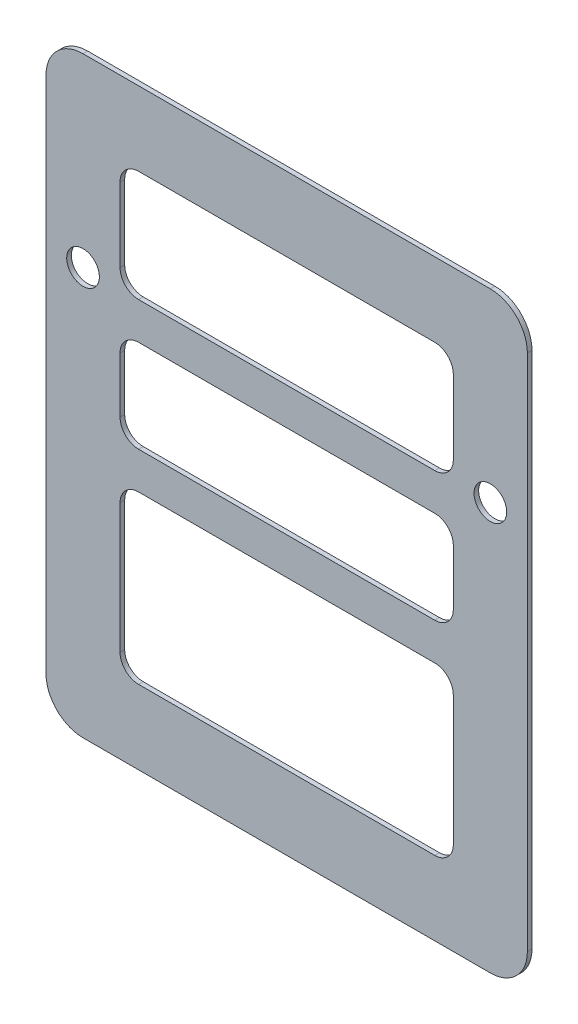
ISO-10303-21;
HEADER;
FILE_DESCRIPTION(('STEP AP214'),'2;1');
FILE_NAME('part.step','',(''),(''),'','','');
FILE_SCHEMA(('AUTOMOTIVE_DESIGN { 1 0 10303 214 1 1 1 1 }'));
ENDSEC;
DATA;
#1=APPLICATION_CONTEXT('core data for automotive mechanical design processes');
#2=APPLICATION_PROTOCOL_DEFINITION('international standard','automotive_design',2000,#1);
#3=PRODUCT_CONTEXT('',#1,'mechanical');
#4=PRODUCT('Part','Part','',(#3));
#5=PRODUCT_RELATED_PRODUCT_CATEGORY('part','',(#4));
#6=PRODUCT_DEFINITION_FORMATION('','',#4);
#7=PRODUCT_DEFINITION_CONTEXT('part definition',#1,'design');
#8=PRODUCT_DEFINITION('design','',#6,#7);
#9=PRODUCT_DEFINITION_SHAPE('','',#8);
#10=(LENGTH_UNIT() NAMED_UNIT(*) SI_UNIT(.MILLI.,.METRE.));
#11=(NAMED_UNIT(*) PLANE_ANGLE_UNIT() SI_UNIT($,.RADIAN.));
#12=(NAMED_UNIT(*) SI_UNIT($,.STERADIAN.) SOLID_ANGLE_UNIT());
#13=UNCERTAINTY_MEASURE_WITH_UNIT(LENGTH_MEASURE(1.E-05),#10,'distance_accuracy_value','');
#14=(GEOMETRIC_REPRESENTATION_CONTEXT(3) GLOBAL_UNCERTAINTY_ASSIGNED_CONTEXT((#13)) GLOBAL_UNIT_ASSIGNED_CONTEXT((#10,
#11,#12)) REPRESENTATION_CONTEXT('',''));
#15=CARTESIAN_POINT('',(0.,0.,0.));
#16=DIRECTION('',(0.,0.,1.));
#17=DIRECTION('',(1.,0.,0.));
#18=AXIS2_PLACEMENT_3D('',#15,#16,#17);
#19=CARTESIAN_POINT('',(-139.7,-177.8,3.175));
#20=DIRECTION('',(0.,0.,-1.));
#21=DIRECTION('',(-1.,0.,0.));
#22=AXIS2_PLACEMENT_3D('',#19,#20,#21);
#23=PLANE('',#22);
#24=CARTESIAN_POINT('',(101.6,0.,3.175));
#25=DIRECTION('',(0.,0.,1.));
#26=DIRECTION('',(1.,0.,0.));
#27=AXIS2_PLACEMENT_3D('',#24,#25,#26);
#28=CIRCLE('',#27,12.7);
#29=CARTESIAN_POINT('',(101.6,-12.7,3.175));
#30=VERTEX_POINT('',#29);
#31=CARTESIAN_POINT('',(114.3,0.,3.175));
#32=VERTEX_POINT('',#31);
#33=EDGE_CURVE('E315',#30,#32,#28,.T.);
#34=ORIENTED_EDGE('',*,*,#33,.F.);
#35=DIRECTION('',(1.,0.,0.));
#36=VECTOR('',#35,1.);
#37=CARTESIAN_POINT('',(-101.6,-12.7,3.175));
#38=LINE('',#37,#36);
#39=CARTESIAN_POINT('',(-101.6,-12.7,3.175));
#40=VERTEX_POINT('',#39);
#41=EDGE_CURVE('E331',#40,#30,#38,.T.);
#42=ORIENTED_EDGE('',*,*,#41,.F.);
#43=CARTESIAN_POINT('',(-101.6,0.,3.175));
#44=DIRECTION('',(0.,0.,1.));
#45=DIRECTION('',(-1.,0.,0.));
#46=AXIS2_PLACEMENT_3D('',#43,#44,#45);
#47=CIRCLE('',#46,12.7);
#48=CARTESIAN_POINT('',(-114.3,0.,3.175));
#49=VERTEX_POINT('',#48);
#50=EDGE_CURVE('E328',#49,#40,#47,.T.);
#51=ORIENTED_EDGE('',*,*,#50,.F.);
#52=DIRECTION('',(0.,-1.,0.));
#53=VECTOR('',#52,1.);
#54=CARTESIAN_POINT('',(-114.3,0.,3.175));
#55=LINE('',#54,#53);
#56=CARTESIAN_POINT('',(-114.3,38.1,3.175));
#57=VERTEX_POINT('',#56);
#58=EDGE_CURVE('E326',#57,#49,#55,.T.);
#59=ORIENTED_EDGE('',*,*,#58,.F.);
#60=CARTESIAN_POINT('',(-101.6,38.1,3.175));
#61=DIRECTION('',(0.,0.,1.));
#62=DIRECTION('',(-1.,0.,0.));
#63=AXIS2_PLACEMENT_3D('',#60,#61,#62);
#64=CIRCLE('',#63,12.7);
#65=CARTESIAN_POINT('',(-101.6,50.8,3.175));
#66=VERTEX_POINT('',#65);
#67=EDGE_CURVE('E324',#66,#57,#64,.T.);
#68=ORIENTED_EDGE('',*,*,#67,.F.);
#69=DIRECTION('',(-1.,0.,0.));
#70=VECTOR('',#69,1.);
#71=CARTESIAN_POINT('',(-101.6,50.8,3.175));
#72=LINE('',#71,#70);
#73=CARTESIAN_POINT('',(101.6,50.8,3.175));
#74=VERTEX_POINT('',#73);
#75=EDGE_CURVE('E322',#74,#66,#72,.T.);
#76=ORIENTED_EDGE('',*,*,#75,.F.);
#77=CARTESIAN_POINT('',(101.6,38.1,3.175));
#78=DIRECTION('',(0.,0.,1.));
#79=DIRECTION('',(-1.,0.,0.));
#80=AXIS2_PLACEMENT_3D('',#77,#78,#79);
#81=CIRCLE('',#80,12.7);
#82=CARTESIAN_POINT('',(114.3,38.1,3.175));
#83=VERTEX_POINT('',#82);
#84=EDGE_CURVE('E320',#83,#74,#81,.T.);
#85=ORIENTED_EDGE('',*,*,#84,.F.);
#86=DIRECTION('',(0.,1.,0.));
#87=VECTOR('',#86,1.);
#88=CARTESIAN_POINT('',(114.3,0.,3.175));
#89=LINE('',#88,#87);
#90=EDGE_CURVE('E317',#32,#83,#89,.T.);
#91=ORIENTED_EDGE('',*,*,#90,.F.);
#92=EDGE_LOOP('',(#34,#42,#51,#59,#68,#76,#85,#91));
#93=FACE_BOUND('',#92,.T.);
#94=CARTESIAN_POINT('',(139.7,76.2,3.175));
#95=DIRECTION('',(0.,0.,1.));
#96=DIRECTION('',(1.,0.,0.));
#97=AXIS2_PLACEMENT_3D('',#94,#95,#96);
#98=CIRCLE('',#97,11.2);
#99=CARTESIAN_POINT('',(150.9,76.2,3.175));
#100=VERTEX_POINT('',#99);
#101=EDGE_CURVE('E433',#100,#100,#98,.T.);
#102=ORIENTED_EDGE('',*,*,#101,.F.);
#103=EDGE_LOOP('',(#102));
#104=FACE_BOUND('',#103,.T.);
#105=CARTESIAN_POINT('',(-139.7,76.2,3.175));
#106=DIRECTION('',(0.,0.,1.));
#107=DIRECTION('',(1.,0.,0.));
#108=AXIS2_PLACEMENT_3D('',#105,#106,#107);
#109=CIRCLE('',#108,11.2);
#110=CARTESIAN_POINT('',(-128.5,76.2,3.175));
#111=VERTEX_POINT('',#110);
#112=EDGE_CURVE('E439',#111,#111,#109,.T.);
#113=ORIENTED_EDGE('',*,*,#112,.F.);
#114=EDGE_LOOP('',(#113));
#115=FACE_BOUND('',#114,.T.);
#116=CARTESIAN_POINT('',(-139.7,-177.8,3.175));
#117=DIRECTION('',(0.,0.,1.));
#118=DIRECTION('',(-1.,0.,0.));
#119=AXIS2_PLACEMENT_3D('',#116,#117,#118);
#120=CIRCLE('',#119,25.4);
#121=CARTESIAN_POINT('',(-165.1,-177.8,3.175));
#122=VERTEX_POINT('',#121);
#123=CARTESIAN_POINT('',(-139.7,-203.2,3.175));
#124=VERTEX_POINT('',#123);
#125=EDGE_CURVE('E445',#122,#124,#120,.T.);
#126=ORIENTED_EDGE('',*,*,#125,.T.);
#127=DIRECTION('',(1.,0.,0.));
#128=VECTOR('',#127,1.);
#129=CARTESIAN_POINT('',(-139.7,-203.2,3.175));
#130=LINE('',#129,#128);
#131=CARTESIAN_POINT('',(139.7,-203.2,3.175));
#132=VERTEX_POINT('',#131);
#133=EDGE_CURVE('E448',#124,#132,#130,.T.);
#134=ORIENTED_EDGE('',*,*,#133,.T.);
#135=CARTESIAN_POINT('',(139.7,-177.8,3.175));
#136=DIRECTION('',(0.,0.,1.));
#137=DIRECTION('',(1.,0.,0.));
#138=AXIS2_PLACEMENT_3D('',#135,#136,#137);
#139=CIRCLE('',#138,25.4);
#140=CARTESIAN_POINT('',(165.1,-177.8,3.175));
#141=VERTEX_POINT('',#140);
#142=EDGE_CURVE('E451',#132,#141,#139,.T.);
#143=ORIENTED_EDGE('',*,*,#142,.T.);
#144=DIRECTION('',(0.,1.,0.));
#145=VECTOR('',#144,1.);
#146=CARTESIAN_POINT('',(165.1,-177.8,3.175));
#147=LINE('',#146,#145);
#148=CARTESIAN_POINT('',(165.1,177.8,3.175));
#149=VERTEX_POINT('',#148);
#150=EDGE_CURVE('E453',#141,#149,#147,.T.);
#151=ORIENTED_EDGE('',*,*,#150,.T.);
#152=CARTESIAN_POINT('',(139.7,177.8,3.175));
#153=DIRECTION('',(0.,0.,1.));
#154=DIRECTION('',(-1.,0.,0.));
#155=AXIS2_PLACEMENT_3D('',#152,#153,#154);
#156=CIRCLE('',#155,25.4);
#157=CARTESIAN_POINT('',(139.7,203.2,3.175));
#158=VERTEX_POINT('',#157);
#159=EDGE_CURVE('E455',#149,#158,#156,.T.);
#160=ORIENTED_EDGE('',*,*,#159,.T.);
#161=DIRECTION('',(-1.,0.,0.));
#162=VECTOR('',#161,1.);
#163=CARTESIAN_POINT('',(-139.7,203.2,3.175));
#164=LINE('',#163,#162);
#165=CARTESIAN_POINT('',(-139.7,203.2,3.175));
#166=VERTEX_POINT('',#165);
#167=EDGE_CURVE('E457',#158,#166,#164,.T.);
#168=ORIENTED_EDGE('',*,*,#167,.T.);
#169=CARTESIAN_POINT('',(-139.7,177.8,3.175));
#170=DIRECTION('',(0.,0.,1.));
#171=DIRECTION('',(-1.,0.,0.));
#172=AXIS2_PLACEMENT_3D('',#169,#170,#171);
#173=CIRCLE('',#172,25.4);
#174=CARTESIAN_POINT('',(-165.1,177.8,3.175));
#175=VERTEX_POINT('',#174);
#176=EDGE_CURVE('E459',#166,#175,#173,.T.);
#177=ORIENTED_EDGE('',*,*,#176,.T.);
#178=DIRECTION('',(0.,-1.,0.));
#179=VECTOR('',#178,1.);
#180=CARTESIAN_POINT('',(-165.1,-177.8,3.175));
#181=LINE('',#180,#179);
#182=EDGE_CURVE('E461',#175,#122,#181,.T.);
#183=ORIENTED_EDGE('',*,*,#182,.T.);
#184=EDGE_LOOP('',(#126,#134,#143,#151,#160,#168,#177,#183));
#185=FACE_BOUND('',#184,.T.);
#186=CARTESIAN_POINT('',(-101.6,-50.8,3.175));
#187=DIRECTION('',(0.,0.,1.));
#188=DIRECTION('',(-1.,0.,0.));
#189=AXIS2_PLACEMENT_3D('',#186,#187,#188);
#190=CIRCLE('',#189,12.7);
#191=CARTESIAN_POINT('',(-101.6,-38.1,3.175));
#192=VERTEX_POINT('',#191);
#193=CARTESIAN_POINT('',(-114.3,-50.8,3.175));
#194=VERTEX_POINT('',#193);
#195=EDGE_CURVE('E374',#192,#194,#190,.T.);
#196=ORIENTED_EDGE('',*,*,#195,.F.);
#197=DIRECTION('',(-1.,0.,0.));
#198=VECTOR('',#197,1.);
#199=CARTESIAN_POINT('',(-101.6,-38.1,3.175));
#200=LINE('',#199,#198);
#201=CARTESIAN_POINT('',(101.6,-38.1,3.175));
#202=VERTEX_POINT('',#201);
#203=EDGE_CURVE('E390',#202,#192,#200,.T.);
#204=ORIENTED_EDGE('',*,*,#203,.F.);
#205=CARTESIAN_POINT('',(101.6,-50.8,3.175));
#206=DIRECTION('',(0.,0.,1.));
#207=DIRECTION('',(-1.,0.,0.));
#208=AXIS2_PLACEMENT_3D('',#205,#206,#207);
#209=CIRCLE('',#208,12.7);
#210=CARTESIAN_POINT('',(114.3,-50.8,3.175));
#211=VERTEX_POINT('',#210);
#212=EDGE_CURVE('E387',#211,#202,#209,.T.);
#213=ORIENTED_EDGE('',*,*,#212,.F.);
#214=DIRECTION('',(0.,1.,0.));
#215=VECTOR('',#214,1.);
#216=CARTESIAN_POINT('',(114.3,-139.7,3.175));
#217=LINE('',#216,#215);
#218=CARTESIAN_POINT('',(114.3,-139.7,3.175));
#219=VERTEX_POINT('',#218);
#220=EDGE_CURVE('E385',#219,#211,#217,.T.);
#221=ORIENTED_EDGE('',*,*,#220,.F.);
#222=CARTESIAN_POINT('',(101.6,-139.7,3.175));
#223=DIRECTION('',(0.,0.,1.));
#224=DIRECTION('',(1.,0.,0.));
#225=AXIS2_PLACEMENT_3D('',#222,#223,#224);
#226=CIRCLE('',#225,12.7);
#227=CARTESIAN_POINT('',(101.6,-152.4,3.175));
#228=VERTEX_POINT('',#227);
#229=EDGE_CURVE('E383',#228,#219,#226,.T.);
#230=ORIENTED_EDGE('',*,*,#229,.F.);
#231=DIRECTION('',(1.,0.,0.));
#232=VECTOR('',#231,1.);
#233=CARTESIAN_POINT('',(-101.6,-152.4,3.175));
#234=LINE('',#233,#232);
#235=CARTESIAN_POINT('',(-101.6,-152.4,3.175));
#236=VERTEX_POINT('',#235);
#237=EDGE_CURVE('E381',#236,#228,#234,.T.);
#238=ORIENTED_EDGE('',*,*,#237,.F.);
#239=CARTESIAN_POINT('',(-101.6,-139.7,3.175));
#240=DIRECTION('',(0.,0.,1.));
#241=DIRECTION('',(-1.,0.,0.));
#242=AXIS2_PLACEMENT_3D('',#239,#240,#241);
#243=CIRCLE('',#242,12.7);
#244=CARTESIAN_POINT('',(-114.3,-139.7,3.175));
#245=VERTEX_POINT('',#244);
#246=EDGE_CURVE('E379',#245,#236,#243,.T.);
#247=ORIENTED_EDGE('',*,*,#246,.F.);
#248=DIRECTION('',(0.,-1.,0.));
#249=VECTOR('',#248,1.);
#250=CARTESIAN_POINT('',(-114.3,-139.7,3.175));
#251=LINE('',#250,#249);
#252=EDGE_CURVE('E376',#194,#245,#251,.T.);
#253=ORIENTED_EDGE('',*,*,#252,.F.);
#254=EDGE_LOOP('',(#196,#204,#213,#221,#230,#238,#247,#253));
#255=FACE_BOUND('',#254,.T.);
#256=CARTESIAN_POINT('',(101.6,88.9,3.175));
#257=DIRECTION('',(0.,0.,1.));
#258=DIRECTION('',(1.,0.,0.));
#259=AXIS2_PLACEMENT_3D('',#256,#257,#258);
#260=CIRCLE('',#259,12.7);
#261=CARTESIAN_POINT('',(101.6,76.2,3.175));
#262=VERTEX_POINT('',#261);
#263=CARTESIAN_POINT('',(114.3,88.9,3.175));
#264=VERTEX_POINT('',#263);
#265=EDGE_CURVE('E250',#262,#264,#260,.T.);
#266=ORIENTED_EDGE('',*,*,#265,.F.);
#267=DIRECTION('',(1.,0.,0.));
#268=VECTOR('',#267,1.);
#269=CARTESIAN_POINT('',(-101.6,76.2,3.175));
#270=LINE('',#269,#268);
#271=CARTESIAN_POINT('',(-101.6,76.2,3.175));
#272=VERTEX_POINT('',#271);
#273=EDGE_CURVE('E283',#272,#262,#270,.T.);
#274=ORIENTED_EDGE('',*,*,#273,.F.);
#275=CARTESIAN_POINT('',(-101.6,88.9,3.175));
#276=DIRECTION('',(0.,0.,1.));
#277=DIRECTION('',(1.,0.,0.));
#278=AXIS2_PLACEMENT_3D('',#275,#276,#277);
#279=CIRCLE('',#278,12.7);
#280=CARTESIAN_POINT('',(-114.3,88.9,3.175));
#281=VERTEX_POINT('',#280);
#282=EDGE_CURVE('E281',#281,#272,#279,.T.);
#283=ORIENTED_EDGE('',*,*,#282,.F.);
#284=DIRECTION('',(0.,-1.,0.));
#285=VECTOR('',#284,1.);
#286=CARTESIAN_POINT('',(-114.3,139.7,3.175));
#287=LINE('',#286,#285);
#288=CARTESIAN_POINT('',(-114.3,139.7,3.175));
#289=VERTEX_POINT('',#288);
#290=EDGE_CURVE('E279',#289,#281,#287,.T.);
#291=ORIENTED_EDGE('',*,*,#290,.F.);
#292=CARTESIAN_POINT('',(-101.6,139.7,3.175));
#293=DIRECTION('',(0.,0.,1.));
#294=DIRECTION('',(1.,0.,0.));
#295=AXIS2_PLACEMENT_3D('',#292,#293,#294);
#296=CIRCLE('',#295,12.7);
#297=CARTESIAN_POINT('',(-101.6,152.4,3.175));
#298=VERTEX_POINT('',#297);
#299=EDGE_CURVE('E277',#298,#289,#296,.T.);
#300=ORIENTED_EDGE('',*,*,#299,.F.);
#301=DIRECTION('',(-1.,0.,0.));
#302=VECTOR('',#301,1.);
#303=CARTESIAN_POINT('',(-101.6,152.4,3.175));
#304=LINE('',#303,#302);
#305=CARTESIAN_POINT('',(101.6,152.4,3.175));
#306=VERTEX_POINT('',#305);
#307=EDGE_CURVE('E273',#306,#298,#304,.T.);
#308=ORIENTED_EDGE('',*,*,#307,.F.);
#309=CARTESIAN_POINT('',(101.6,139.7,3.175));
#310=DIRECTION('',(0.,0.,1.));
#311=DIRECTION('',(-1.,0.,0.));
#312=AXIS2_PLACEMENT_3D('',#309,#310,#311);
#313=CIRCLE('',#312,12.7);
#314=CARTESIAN_POINT('',(114.3,139.7,3.175));
#315=VERTEX_POINT('',#314);
#316=EDGE_CURVE('E271',#315,#306,#313,.T.);
#317=ORIENTED_EDGE('',*,*,#316,.F.);
#318=DIRECTION('',(0.,1.,0.));
#319=VECTOR('',#318,1.);
#320=CARTESIAN_POINT('',(114.3,139.7,3.175));
#321=LINE('',#320,#319);
#322=EDGE_CURVE('E258',#264,#315,#321,.T.);
#323=ORIENTED_EDGE('',*,*,#322,.F.);
#324=EDGE_LOOP('',(#266,#274,#283,#291,#300,#308,#317,#323));
#325=FACE_BOUND('',#324,.T.);
#326=ADVANCED_FACE('F41',(#93,#104,#115,#185,#255,#325),#23,.F.);
#327=CARTESIAN_POINT('',(-139.7,-177.8,0.));
#328=DIRECTION('',(0.,0.,-1.));
#329=DIRECTION('',(-1.,0.,0.));
#330=AXIS2_PLACEMENT_3D('',#327,#328,#329);
#331=PLANE('',#330);
#332=CARTESIAN_POINT('',(-139.7,76.2,0.));
#333=DIRECTION('',(0.,0.,1.));
#334=DIRECTION('',(1.,0.,0.));
#335=AXIS2_PLACEMENT_3D('',#332,#333,#334);
#336=CIRCLE('',#335,11.2);
#337=CARTESIAN_POINT('',(-128.5,76.2,0.));
#338=VERTEX_POINT('',#337);
#339=EDGE_CURVE('E436',#338,#338,#336,.T.);
#340=ORIENTED_EDGE('',*,*,#339,.T.);
#341=EDGE_LOOP('',(#340));
#342=FACE_BOUND('',#341,.T.);
#343=CARTESIAN_POINT('',(-139.7,-177.8,0.));
#344=DIRECTION('',(0.,0.,1.));
#345=DIRECTION('',(-1.,0.,0.));
#346=AXIS2_PLACEMENT_3D('',#343,#344,#345);
#347=CIRCLE('',#346,25.4);
#348=CARTESIAN_POINT('',(-165.1,-177.8,0.));
#349=VERTEX_POINT('',#348);
#350=CARTESIAN_POINT('',(-139.7,-203.2,0.));
#351=VERTEX_POINT('',#350);
#352=EDGE_CURVE('E442',#349,#351,#347,.T.);
#353=ORIENTED_EDGE('',*,*,#352,.F.);
#354=DIRECTION('',(0.,-1.,0.));
#355=VECTOR('',#354,1.);
#356=CARTESIAN_POINT('',(-165.1,-177.8,0.));
#357=LINE('',#356,#355);
#358=CARTESIAN_POINT('',(-165.1,177.8,0.));
#359=VERTEX_POINT('',#358);
#360=EDGE_CURVE('E449',#359,#349,#357,.T.);
#361=ORIENTED_EDGE('',*,*,#360,.F.);
#362=CARTESIAN_POINT('',(-139.7,177.8,0.));
#363=DIRECTION('',(0.,0.,1.));
#364=DIRECTION('',(-1.,0.,0.));
#365=AXIS2_PLACEMENT_3D('',#362,#363,#364);
#366=CIRCLE('',#365,25.4);
#367=CARTESIAN_POINT('',(-139.7,203.2,0.));
#368=VERTEX_POINT('',#367);
#369=EDGE_CURVE('E476',#368,#359,#366,.T.);
#370=ORIENTED_EDGE('',*,*,#369,.F.);
#371=DIRECTION('',(-1.,0.,0.));
#372=VECTOR('',#371,1.);
#373=CARTESIAN_POINT('',(-139.7,203.2,0.));
#374=LINE('',#373,#372);
#375=CARTESIAN_POINT('',(139.7,203.2,0.));
#376=VERTEX_POINT('',#375);
#377=EDGE_CURVE('E474',#376,#368,#374,.T.);
#378=ORIENTED_EDGE('',*,*,#377,.F.);
#379=CARTESIAN_POINT('',(139.7,177.8,0.));
#380=DIRECTION('',(0.,0.,1.));
#381=DIRECTION('',(-1.,0.,0.));
#382=AXIS2_PLACEMENT_3D('',#379,#380,#381);
#383=CIRCLE('',#382,25.4);
#384=CARTESIAN_POINT('',(165.1,177.8,0.));
#385=VERTEX_POINT('',#384);
#386=EDGE_CURVE('E472',#385,#376,#383,.T.);
#387=ORIENTED_EDGE('',*,*,#386,.F.);
#388=DIRECTION('',(0.,1.,0.));
#389=VECTOR('',#388,1.);
#390=CARTESIAN_POINT('',(165.1,-177.8,0.));
#391=LINE('',#390,#389);
#392=CARTESIAN_POINT('',(165.1,-177.8,0.));
#393=VERTEX_POINT('',#392);
#394=EDGE_CURVE('E470',#393,#385,#391,.T.);
#395=ORIENTED_EDGE('',*,*,#394,.F.);
#396=CARTESIAN_POINT('',(139.7,-177.8,0.));
#397=DIRECTION('',(0.,0.,1.));
#398=DIRECTION('',(1.,0.,0.));
#399=AXIS2_PLACEMENT_3D('',#396,#397,#398);
#400=CIRCLE('',#399,25.4);
#401=CARTESIAN_POINT('',(139.7,-203.2,0.));
#402=VERTEX_POINT('',#401);
#403=EDGE_CURVE('E468',#402,#393,#400,.T.);
#404=ORIENTED_EDGE('',*,*,#403,.F.);
#405=DIRECTION('',(1.,0.,0.));
#406=VECTOR('',#405,1.);
#407=CARTESIAN_POINT('',(-139.7,-203.2,0.));
#408=LINE('',#407,#406);
#409=EDGE_CURVE('E466',#351,#402,#408,.T.);
#410=ORIENTED_EDGE('',*,*,#409,.F.);
#411=EDGE_LOOP('',(#353,#361,#370,#378,#387,#395,#404,#410));
#412=FACE_BOUND('',#411,.T.);
#413=CARTESIAN_POINT('',(139.7,76.2,0.));
#414=DIRECTION('',(0.,0.,1.));
#415=DIRECTION('',(1.,0.,0.));
#416=AXIS2_PLACEMENT_3D('',#413,#414,#415);
#417=CIRCLE('',#416,11.2);
#418=CARTESIAN_POINT('',(150.9,76.2,0.));
#419=VERTEX_POINT('',#418);
#420=EDGE_CURVE('E432',#419,#419,#417,.T.);
#421=ORIENTED_EDGE('',*,*,#420,.T.);
#422=EDGE_LOOP('',(#421));
#423=FACE_BOUND('',#422,.T.);
#424=DIRECTION('',(-1.,0.,0.));
#425=VECTOR('',#424,1.);
#426=CARTESIAN_POINT('',(-101.6,-38.1,0.));
#427=LINE('',#426,#425);
#428=CARTESIAN_POINT('',(101.6,-38.1,0.));
#429=VERTEX_POINT('',#428);
#430=CARTESIAN_POINT('',(-101.6,-38.1,0.));
#431=VERTEX_POINT('',#430);
#432=EDGE_CURVE('E377',#429,#431,#427,.T.);
#433=ORIENTED_EDGE('',*,*,#432,.T.);
#434=CARTESIAN_POINT('',(-101.6,-50.8,0.));
#435=DIRECTION('',(0.,0.,1.));
#436=DIRECTION('',(-1.,0.,0.));
#437=AXIS2_PLACEMENT_3D('',#434,#435,#436);
#438=CIRCLE('',#437,12.7);
#439=CARTESIAN_POINT('',(-114.3,-50.8,0.));
#440=VERTEX_POINT('',#439);
#441=EDGE_CURVE('E373',#431,#440,#438,.T.);
#442=ORIENTED_EDGE('',*,*,#441,.T.);
#443=DIRECTION('',(0.,-1.,0.));
#444=VECTOR('',#443,1.);
#445=CARTESIAN_POINT('',(-114.3,-139.7,0.));
#446=LINE('',#445,#444);
#447=CARTESIAN_POINT('',(-114.3,-139.7,0.));
#448=VERTEX_POINT('',#447);
#449=EDGE_CURVE('E395',#440,#448,#446,.T.);
#450=ORIENTED_EDGE('',*,*,#449,.T.);
#451=CARTESIAN_POINT('',(-101.6,-139.7,0.));
#452=DIRECTION('',(0.,0.,1.));
#453=DIRECTION('',(-1.,0.,0.));
#454=AXIS2_PLACEMENT_3D('',#451,#452,#453);
#455=CIRCLE('',#454,12.7);
#456=CARTESIAN_POINT('',(-101.6,-152.4,0.));
#457=VERTEX_POINT('',#456);
#458=EDGE_CURVE('E398',#448,#457,#455,.T.);
#459=ORIENTED_EDGE('',*,*,#458,.T.);
#460=DIRECTION('',(1.,0.,0.));
#461=VECTOR('',#460,1.);
#462=CARTESIAN_POINT('',(-101.6,-152.4,0.));
#463=LINE('',#462,#461);
#464=CARTESIAN_POINT('',(101.6,-152.4,0.));
#465=VERTEX_POINT('',#464);
#466=EDGE_CURVE('E401',#457,#465,#463,.T.);
#467=ORIENTED_EDGE('',*,*,#466,.T.);
#468=CARTESIAN_POINT('',(101.6,-139.7,0.));
#469=DIRECTION('',(0.,0.,1.));
#470=DIRECTION('',(1.,0.,0.));
#471=AXIS2_PLACEMENT_3D('',#468,#469,#470);
#472=CIRCLE('',#471,12.7);
#473=CARTESIAN_POINT('',(114.3,-139.7,0.));
#474=VERTEX_POINT('',#473);
#475=EDGE_CURVE('E404',#465,#474,#472,.T.);
#476=ORIENTED_EDGE('',*,*,#475,.T.);
#477=DIRECTION('',(0.,1.,0.));
#478=VECTOR('',#477,1.);
#479=CARTESIAN_POINT('',(114.3,-139.7,0.));
#480=LINE('',#479,#478);
#481=CARTESIAN_POINT('',(114.3,-50.8,0.));
#482=VERTEX_POINT('',#481);
#483=EDGE_CURVE('E407',#474,#482,#480,.T.);
#484=ORIENTED_EDGE('',*,*,#483,.T.);
#485=CARTESIAN_POINT('',(101.6,-50.8,0.));
#486=DIRECTION('',(0.,0.,1.));
#487=DIRECTION('',(-1.,0.,0.));
#488=AXIS2_PLACEMENT_3D('',#485,#486,#487);
#489=CIRCLE('',#488,12.7);
#490=EDGE_CURVE('E410',#482,#429,#489,.T.);
#491=ORIENTED_EDGE('',*,*,#490,.T.);
#492=EDGE_LOOP('',(#433,#442,#450,#459,#467,#476,#484,#491));
#493=FACE_BOUND('',#492,.T.);
#494=DIRECTION('',(1.,0.,0.));
#495=VECTOR('',#494,1.);
#496=CARTESIAN_POINT('',(-101.6,-12.7,0.));
#497=LINE('',#496,#495);
#498=CARTESIAN_POINT('',(-101.6,-12.7,0.));
#499=VERTEX_POINT('',#498);
#500=CARTESIAN_POINT('',(101.6,-12.7,0.));
#501=VERTEX_POINT('',#500);
#502=EDGE_CURVE('E318',#499,#501,#497,.T.);
#503=ORIENTED_EDGE('',*,*,#502,.T.);
#504=CARTESIAN_POINT('',(101.6,0.,0.));
#505=DIRECTION('',(0.,0.,1.));
#506=DIRECTION('',(1.,0.,0.));
#507=AXIS2_PLACEMENT_3D('',#504,#505,#506);
#508=CIRCLE('',#507,12.7);
#509=CARTESIAN_POINT('',(114.3,0.,0.));
#510=VERTEX_POINT('',#509);
#511=EDGE_CURVE('E266',#501,#510,#508,.T.);
#512=ORIENTED_EDGE('',*,*,#511,.T.);
#513=DIRECTION('',(0.,1.,0.));
#514=VECTOR('',#513,1.);
#515=CARTESIAN_POINT('',(114.3,0.,0.));
#516=LINE('',#515,#514);
#517=CARTESIAN_POINT('',(114.3,38.1,0.));
#518=VERTEX_POINT('',#517);
#519=EDGE_CURVE('E336',#510,#518,#516,.T.);
#520=ORIENTED_EDGE('',*,*,#519,.T.);
#521=CARTESIAN_POINT('',(101.6,38.1,0.));
#522=DIRECTION('',(0.,0.,1.));
#523=DIRECTION('',(-1.,0.,0.));
#524=AXIS2_PLACEMENT_3D('',#521,#522,#523);
#525=CIRCLE('',#524,12.7);
#526=CARTESIAN_POINT('',(101.6,50.8,0.));
#527=VERTEX_POINT('',#526);
#528=EDGE_CURVE('E339',#518,#527,#525,.T.);
#529=ORIENTED_EDGE('',*,*,#528,.T.);
#530=DIRECTION('',(-1.,0.,0.));
#531=VECTOR('',#530,1.);
#532=CARTESIAN_POINT('',(-101.6,50.8,0.));
#533=LINE('',#532,#531);
#534=CARTESIAN_POINT('',(-101.6,50.8,0.));
#535=VERTEX_POINT('',#534);
#536=EDGE_CURVE('E342',#527,#535,#533,.T.);
#537=ORIENTED_EDGE('',*,*,#536,.T.);
#538=CARTESIAN_POINT('',(-101.6,38.1,0.));
#539=DIRECTION('',(0.,0.,1.));
#540=DIRECTION('',(-1.,0.,0.));
#541=AXIS2_PLACEMENT_3D('',#538,#539,#540);
#542=CIRCLE('',#541,12.7);
#543=CARTESIAN_POINT('',(-114.3,38.1,0.));
#544=VERTEX_POINT('',#543);
#545=EDGE_CURVE('E345',#535,#544,#542,.T.);
#546=ORIENTED_EDGE('',*,*,#545,.T.);
#547=DIRECTION('',(0.,-1.,0.));
#548=VECTOR('',#547,1.);
#549=CARTESIAN_POINT('',(-114.3,0.,0.));
#550=LINE('',#549,#548);
#551=CARTESIAN_POINT('',(-114.3,0.,0.));
#552=VERTEX_POINT('',#551);
#553=EDGE_CURVE('E348',#544,#552,#550,.T.);
#554=ORIENTED_EDGE('',*,*,#553,.T.);
#555=CARTESIAN_POINT('',(-101.6,0.,0.));
#556=DIRECTION('',(0.,0.,1.));
#557=DIRECTION('',(-1.,0.,0.));
#558=AXIS2_PLACEMENT_3D('',#555,#556,#557);
#559=CIRCLE('',#558,12.7);
#560=EDGE_CURVE('E351',#552,#499,#559,.T.);
#561=ORIENTED_EDGE('',*,*,#560,.T.);
#562=EDGE_LOOP('',(#503,#512,#520,#529,#537,#546,#554,#561));
#563=FACE_BOUND('',#562,.T.);
#564=DIRECTION('',(1.,0.,0.));
#565=VECTOR('',#564,1.);
#566=CARTESIAN_POINT('',(-101.6,76.2,0.));
#567=LINE('',#566,#565);
#568=CARTESIAN_POINT('',(-101.6,76.2,0.));
#569=VERTEX_POINT('',#568);
#570=CARTESIAN_POINT('',(101.6,76.2,0.));
#571=VERTEX_POINT('',#570);
#572=EDGE_CURVE('E259',#569,#571,#567,.T.);
#573=ORIENTED_EDGE('',*,*,#572,.T.);
#574=CARTESIAN_POINT('',(101.6,88.9,0.));
#575=DIRECTION('',(0.,0.,1.));
#576=DIRECTION('',(1.,0.,0.));
#577=AXIS2_PLACEMENT_3D('',#574,#575,#576);
#578=CIRCLE('',#577,12.7);
#579=CARTESIAN_POINT('',(114.3,88.9,0.));
#580=VERTEX_POINT('',#579);
#581=EDGE_CURVE('E64',#571,#580,#578,.T.);
#582=ORIENTED_EDGE('',*,*,#581,.T.);
#583=DIRECTION('',(0.,1.,0.));
#584=VECTOR('',#583,1.);
#585=CARTESIAN_POINT('',(114.3,139.7,0.));
#586=LINE('',#585,#584);
#587=CARTESIAN_POINT('',(114.3,139.7,0.));
#588=VERTEX_POINT('',#587);
#589=EDGE_CURVE('E265',#580,#588,#586,.T.);
#590=ORIENTED_EDGE('',*,*,#589,.T.);
#591=CARTESIAN_POINT('',(101.6,139.7,0.));
#592=DIRECTION('',(0.,0.,1.));
#593=DIRECTION('',(-1.,0.,0.));
#594=AXIS2_PLACEMENT_3D('',#591,#592,#593);
#595=CIRCLE('',#594,12.7);
#596=CARTESIAN_POINT('',(101.6,152.4,0.));
#597=VERTEX_POINT('',#596);
#598=EDGE_CURVE('E287',#588,#597,#595,.T.);
#599=ORIENTED_EDGE('',*,*,#598,.T.);
#600=DIRECTION('',(-1.,0.,0.));
#601=VECTOR('',#600,1.);
#602=CARTESIAN_POINT('',(-101.6,152.4,0.));
#603=LINE('',#602,#601);
#604=CARTESIAN_POINT('',(-101.6,152.4,0.));
#605=VERTEX_POINT('',#604);
#606=EDGE_CURVE('E290',#597,#605,#603,.T.);
#607=ORIENTED_EDGE('',*,*,#606,.T.);
#608=CARTESIAN_POINT('',(-101.6,139.7,0.));
#609=DIRECTION('',(0.,0.,1.));
#610=DIRECTION('',(1.,0.,0.));
#611=AXIS2_PLACEMENT_3D('',#608,#609,#610);
#612=CIRCLE('',#611,12.7);
#613=CARTESIAN_POINT('',(-114.3,139.7,0.));
#614=VERTEX_POINT('',#613);
#615=EDGE_CURVE('E293',#605,#614,#612,.T.);
#616=ORIENTED_EDGE('',*,*,#615,.T.);
#617=DIRECTION('',(0.,-1.,0.));
#618=VECTOR('',#617,1.);
#619=CARTESIAN_POINT('',(-114.3,139.7,0.));
#620=LINE('',#619,#618);
#621=CARTESIAN_POINT('',(-114.3,88.9,0.));
#622=VERTEX_POINT('',#621);
#623=EDGE_CURVE('E296',#614,#622,#620,.T.);
#624=ORIENTED_EDGE('',*,*,#623,.T.);
#625=CARTESIAN_POINT('',(-101.6,88.9,0.));
#626=DIRECTION('',(0.,0.,1.));
#627=DIRECTION('',(1.,0.,0.));
#628=AXIS2_PLACEMENT_3D('',#625,#626,#627);
#629=CIRCLE('',#628,12.7);
#630=EDGE_CURVE('E299',#622,#569,#629,.T.);
#631=ORIENTED_EDGE('',*,*,#630,.T.);
#632=EDGE_LOOP('',(#573,#582,#590,#599,#607,#616,#624,#631));
#633=FACE_BOUND('',#632,.T.);
#634=ADVANCED_FACE('F506',(#342,#412,#423,#493,#563,#633),#331,.T.);
#635=CARTESIAN_POINT('',(-139.7,-177.8,3.175));
#636=DIRECTION('',(0.,0.,-1.));
#637=DIRECTION('',(-1.,0.,0.));
#638=AXIS2_PLACEMENT_3D('',#635,#636,#637);
#639=CYLINDRICAL_SURFACE('',#638,25.4);
#640=ORIENTED_EDGE('',*,*,#352,.T.);
#641=DIRECTION('',(0.,0.,-1.));
#642=VECTOR('',#641,1.);
#643=CARTESIAN_POINT('',(-139.7,-203.2,3.175));
#644=LINE('',#643,#642);
#645=EDGE_CURVE('E11',#124,#351,#644,.T.);
#646=ORIENTED_EDGE('',*,*,#645,.F.);
#647=ORIENTED_EDGE('',*,*,#125,.F.);
#648=DIRECTION('',(0.,0.,-1.));
#649=VECTOR('',#648,1.);
#650=CARTESIAN_POINT('',(-165.1,-177.8,3.175));
#651=LINE('',#650,#649);
#652=EDGE_CURVE('E463',#122,#349,#651,.T.);
#653=ORIENTED_EDGE('',*,*,#652,.T.);
#654=EDGE_LOOP('',(#640,#646,#647,#653));
#655=FACE_BOUND('',#654,.T.);
#656=ADVANCED_FACE('F43',(#655),#639,.T.);
#657=CARTESIAN_POINT('',(-139.7,-203.2,3.175));
#658=DIRECTION('',(0.,1.,0.));
#659=DIRECTION('',(-1.,0.,0.));
#660=AXIS2_PLACEMENT_3D('',#657,#658,#659);
#661=PLANE('',#660);
#662=ORIENTED_EDGE('',*,*,#409,.T.);
#663=DIRECTION('',(0.,0.,-1.));
#664=VECTOR('',#663,1.);
#665=CARTESIAN_POINT('',(139.7,-203.2,3.175));
#666=LINE('',#665,#664);
#667=EDGE_CURVE('E49',#132,#402,#666,.T.);
#668=ORIENTED_EDGE('',*,*,#667,.F.);
#669=ORIENTED_EDGE('',*,*,#133,.F.);
#670=ORIENTED_EDGE('',*,*,#645,.T.);
#671=EDGE_LOOP('',(#662,#668,#669,#670));
#672=FACE_BOUND('',#671,.T.);
#673=ADVANCED_FACE('F524',(#672),#661,.F.);
#674=CARTESIAN_POINT('',(139.7,-177.8,3.175));
#675=DIRECTION('',(0.,0.,-1.));
#676=DIRECTION('',(-1.,0.,0.));
#677=AXIS2_PLACEMENT_3D('',#674,#675,#676);
#678=CYLINDRICAL_SURFACE('',#677,25.4);
#679=ORIENTED_EDGE('',*,*,#403,.T.);
#680=DIRECTION('',(0.,0.,-1.));
#681=VECTOR('',#680,1.);
#682=CARTESIAN_POINT('',(165.1,-177.8,3.175));
#683=LINE('',#682,#681);
#684=EDGE_CURVE('E493',#141,#393,#683,.T.);
#685=ORIENTED_EDGE('',*,*,#684,.F.);
#686=ORIENTED_EDGE('',*,*,#142,.F.);
#687=ORIENTED_EDGE('',*,*,#667,.T.);
#688=EDGE_LOOP('',(#679,#685,#686,#687));
#689=FACE_BOUND('',#688,.T.);
#690=ADVANCED_FACE('F500',(#689),#678,.T.);
#691=CARTESIAN_POINT('',(165.1,-177.8,3.175));
#692=DIRECTION('',(-1.,0.,0.));
#693=DIRECTION('',(0.,0.,1.));
#694=AXIS2_PLACEMENT_3D('',#691,#692,#693);
#695=PLANE('',#694);
#696=ORIENTED_EDGE('',*,*,#394,.T.);
#697=DIRECTION('',(0.,0.,-1.));
#698=VECTOR('',#697,1.);
#699=CARTESIAN_POINT('',(165.1,177.8,3.175));
#700=LINE('',#699,#698);
#701=EDGE_CURVE('E490',#149,#385,#700,.T.);
#702=ORIENTED_EDGE('',*,*,#701,.F.);
#703=ORIENTED_EDGE('',*,*,#150,.F.);
#704=ORIENTED_EDGE('',*,*,#684,.T.);
#705=EDGE_LOOP('',(#696,#702,#703,#704));
#706=FACE_BOUND('',#705,.T.);
#707=ADVANCED_FACE('F512',(#706),#695,.F.);
#708=CARTESIAN_POINT('',(139.7,177.8,3.175));
#709=DIRECTION('',(0.,0.,-1.));
#710=DIRECTION('',(-1.,0.,0.));
#711=AXIS2_PLACEMENT_3D('',#708,#709,#710);
#712=CYLINDRICAL_SURFACE('',#711,25.4);
#713=ORIENTED_EDGE('',*,*,#386,.T.);
#714=DIRECTION('',(0.,0.,-1.));
#715=VECTOR('',#714,1.);
#716=CARTESIAN_POINT('',(139.7,203.2,3.175));
#717=LINE('',#716,#715);
#718=EDGE_CURVE('E487',#158,#376,#717,.T.);
#719=ORIENTED_EDGE('',*,*,#718,.F.);
#720=ORIENTED_EDGE('',*,*,#159,.F.);
#721=ORIENTED_EDGE('',*,*,#701,.T.);
#722=EDGE_LOOP('',(#713,#719,#720,#721));
#723=FACE_BOUND('',#722,.T.);
#724=ADVANCED_FACE('F516',(#723),#712,.T.);
#725=CARTESIAN_POINT('',(-139.7,203.2,3.175));
#726=DIRECTION('',(0.,-1.,0.));
#727=DIRECTION('',(1.,0.,0.));
#728=AXIS2_PLACEMENT_3D('',#725,#726,#727);
#729=PLANE('',#728);
#730=ORIENTED_EDGE('',*,*,#377,.T.);
#731=DIRECTION('',(0.,0.,-1.));
#732=VECTOR('',#731,1.);
#733=CARTESIAN_POINT('',(-139.7,203.2,3.175));
#734=LINE('',#733,#732);
#735=EDGE_CURVE('E484',#166,#368,#734,.T.);
#736=ORIENTED_EDGE('',*,*,#735,.F.);
#737=ORIENTED_EDGE('',*,*,#167,.F.);
#738=ORIENTED_EDGE('',*,*,#718,.T.);
#739=EDGE_LOOP('',(#730,#736,#737,#738));
#740=FACE_BOUND('',#739,.T.);
#741=ADVANCED_FACE('F537',(#740),#729,.F.);
#742=CARTESIAN_POINT('',(-139.7,177.8,3.175));
#743=DIRECTION('',(0.,0.,-1.));
#744=DIRECTION('',(-1.,0.,0.));
#745=AXIS2_PLACEMENT_3D('',#742,#743,#744);
#746=CYLINDRICAL_SURFACE('',#745,25.4);
#747=ORIENTED_EDGE('',*,*,#369,.T.);
#748=DIRECTION('',(0.,0.,-1.));
#749=VECTOR('',#748,1.);
#750=CARTESIAN_POINT('',(-165.1,177.8,3.175));
#751=LINE('',#750,#749);
#752=EDGE_CURVE('E481',#175,#359,#751,.T.);
#753=ORIENTED_EDGE('',*,*,#752,.F.);
#754=ORIENTED_EDGE('',*,*,#176,.F.);
#755=ORIENTED_EDGE('',*,*,#735,.T.);
#756=EDGE_LOOP('',(#747,#753,#754,#755));
#757=FACE_BOUND('',#756,.T.);
#758=ADVANCED_FACE('F535',(#757),#746,.T.);
#759=CARTESIAN_POINT('',(-165.1,-177.8,3.175));
#760=DIRECTION('',(1.,0.,0.));
#761=DIRECTION('',(0.,0.,-1.));
#762=AXIS2_PLACEMENT_3D('',#759,#760,#761);
#763=PLANE('',#762);
#764=ORIENTED_EDGE('',*,*,#360,.T.);
#765=ORIENTED_EDGE('',*,*,#652,.F.);
#766=ORIENTED_EDGE('',*,*,#182,.F.);
#767=ORIENTED_EDGE('',*,*,#752,.T.);
#768=EDGE_LOOP('',(#764,#765,#766,#767));
#769=FACE_BOUND('',#768,.T.);
#770=ADVANCED_FACE('F530',(#769),#763,.F.);
#771=CARTESIAN_POINT('',(-139.7,76.2,3.175));
#772=DIRECTION('',(0.,0.,-1.));
#773=DIRECTION('',(-1.,0.,0.));
#774=AXIS2_PLACEMENT_3D('',#771,#772,#773);
#775=CYLINDRICAL_SURFACE('',#774,11.2);
#776=ORIENTED_EDGE('',*,*,#112,.T.);
#777=EDGE_LOOP('',(#776));
#778=FACE_BOUND('',#777,.T.);
#779=ORIENTED_EDGE('',*,*,#339,.F.);
#780=EDGE_LOOP('',(#779));
#781=FACE_BOUND('',#780,.T.);
#782=ADVANCED_FACE('F557',(#778,#781),#775,.F.);
#783=CARTESIAN_POINT('',(139.7,76.2,3.175));
#784=DIRECTION('',(0.,0.,-1.));
#785=DIRECTION('',(-1.,0.,0.));
#786=AXIS2_PLACEMENT_3D('',#783,#784,#785);
#787=CYLINDRICAL_SURFACE('',#786,11.2);
#788=ORIENTED_EDGE('',*,*,#101,.T.);
#789=EDGE_LOOP('',(#788));
#790=FACE_BOUND('',#789,.T.);
#791=ORIENTED_EDGE('',*,*,#420,.F.);
#792=EDGE_LOOP('',(#791));
#793=FACE_BOUND('',#792,.T.);
#794=ADVANCED_FACE('F564',(#790,#793),#787,.F.);
#795=CARTESIAN_POINT('',(-101.6,-50.8,3.175));
#796=DIRECTION('',(0.,0.,-1.));
#797=DIRECTION('',(-1.,0.,0.));
#798=AXIS2_PLACEMENT_3D('',#795,#796,#797);
#799=CYLINDRICAL_SURFACE('',#798,12.7);
#800=ORIENTED_EDGE('',*,*,#441,.F.);
#801=DIRECTION('',(0.,0.,-1.));
#802=VECTOR('',#801,1.);
#803=CARTESIAN_POINT('',(-101.6,-38.1,3.175));
#804=LINE('',#803,#802);
#805=EDGE_CURVE('E392',#192,#431,#804,.T.);
#806=ORIENTED_EDGE('',*,*,#805,.F.);
#807=ORIENTED_EDGE('',*,*,#195,.T.);
#808=DIRECTION('',(0.,0.,-1.));
#809=VECTOR('',#808,1.);
#810=CARTESIAN_POINT('',(-114.3,-50.8,3.175));
#811=LINE('',#810,#809);
#812=EDGE_CURVE('E429',#194,#440,#811,.T.);
#813=ORIENTED_EDGE('',*,*,#812,.T.);
#814=EDGE_LOOP('',(#800,#806,#807,#813));
#815=FACE_BOUND('',#814,.T.);
#816=ADVANCED_FACE('F569',(#815),#799,.F.);
#817=CARTESIAN_POINT('',(-114.3,-139.7,3.175));
#818=DIRECTION('',(1.,0.,0.));
#819=DIRECTION('',(0.,0.,-1.));
#820=AXIS2_PLACEMENT_3D('',#817,#818,#819);
#821=PLANE('',#820);
#822=ORIENTED_EDGE('',*,*,#449,.F.);
#823=ORIENTED_EDGE('',*,*,#812,.F.);
#824=ORIENTED_EDGE('',*,*,#252,.T.);
#825=DIRECTION('',(0.,0.,-1.));
#826=VECTOR('',#825,1.);
#827=CARTESIAN_POINT('',(-114.3,-139.7,3.175));
#828=LINE('',#827,#826);
#829=EDGE_CURVE('E427',#245,#448,#828,.T.);
#830=ORIENTED_EDGE('',*,*,#829,.T.);
#831=EDGE_LOOP('',(#822,#823,#824,#830));
#832=FACE_BOUND('',#831,.T.);
#833=ADVANCED_FACE('F578',(#832),#821,.T.);
#834=CARTESIAN_POINT('',(-101.6,-139.7,3.175));
#835=DIRECTION('',(0.,0.,-1.));
#836=DIRECTION('',(-1.,0.,0.));
#837=AXIS2_PLACEMENT_3D('',#834,#835,#836);
#838=CYLINDRICAL_SURFACE('',#837,12.7);
#839=ORIENTED_EDGE('',*,*,#458,.F.);
#840=ORIENTED_EDGE('',*,*,#829,.F.);
#841=ORIENTED_EDGE('',*,*,#246,.T.);
#842=DIRECTION('',(0.,0.,-1.));
#843=VECTOR('',#842,1.);
#844=CARTESIAN_POINT('',(-101.6,-152.4,3.175));
#845=LINE('',#844,#843);
#846=EDGE_CURVE('E425',#236,#457,#845,.T.);
#847=ORIENTED_EDGE('',*,*,#846,.T.);
#848=EDGE_LOOP('',(#839,#840,#841,#847));
#849=FACE_BOUND('',#848,.T.);
#850=ADVANCED_FACE('F585',(#849),#838,.F.);
#851=CARTESIAN_POINT('',(-101.6,-152.4,3.175));
#852=DIRECTION('',(0.,1.,0.));
#853=DIRECTION('',(0.,0.,1.));
#854=AXIS2_PLACEMENT_3D('',#851,#852,#853);
#855=PLANE('',#854);
#856=ORIENTED_EDGE('',*,*,#466,.F.);
#857=ORIENTED_EDGE('',*,*,#846,.F.);
#858=ORIENTED_EDGE('',*,*,#237,.T.);
#859=DIRECTION('',(0.,0.,-1.));
#860=VECTOR('',#859,1.);
#861=CARTESIAN_POINT('',(101.6,-152.4,3.175));
#862=LINE('',#861,#860);
#863=EDGE_CURVE('E423',#228,#465,#862,.T.);
#864=ORIENTED_EDGE('',*,*,#863,.T.);
#865=EDGE_LOOP('',(#856,#857,#858,#864));
#866=FACE_BOUND('',#865,.T.);
#867=ADVANCED_FACE('F589',(#866),#855,.T.);
#868=CARTESIAN_POINT('',(101.6,-139.7,3.175));
#869=DIRECTION('',(0.,0.,-1.));
#870=DIRECTION('',(-1.,0.,0.));
#871=AXIS2_PLACEMENT_3D('',#868,#869,#870);
#872=CYLINDRICAL_SURFACE('',#871,12.7);
#873=ORIENTED_EDGE('',*,*,#475,.F.);
#874=ORIENTED_EDGE('',*,*,#863,.F.);
#875=ORIENTED_EDGE('',*,*,#229,.T.);
#876=DIRECTION('',(0.,0.,-1.));
#877=VECTOR('',#876,1.);
#878=CARTESIAN_POINT('',(114.3,-139.7,3.175));
#879=LINE('',#878,#877);
#880=EDGE_CURVE('E421',#219,#474,#879,.T.);
#881=ORIENTED_EDGE('',*,*,#880,.T.);
#882=EDGE_LOOP('',(#873,#874,#875,#881));
#883=FACE_BOUND('',#882,.T.);
#884=ADVANCED_FACE('F593',(#883),#872,.F.);
#885=CARTESIAN_POINT('',(114.3,-139.7,3.175));
#886=DIRECTION('',(-1.,0.,0.));
#887=DIRECTION('',(0.,-1.,0.));
#888=AXIS2_PLACEMENT_3D('',#885,#886,#887);
#889=PLANE('',#888);
#890=ORIENTED_EDGE('',*,*,#483,.F.);
#891=ORIENTED_EDGE('',*,*,#880,.F.);
#892=ORIENTED_EDGE('',*,*,#220,.T.);
#893=DIRECTION('',(0.,0.,-1.));
#894=VECTOR('',#893,1.);
#895=CARTESIAN_POINT('',(114.3,-50.8,3.175));
#896=LINE('',#895,#894);
#897=EDGE_CURVE('E419',#211,#482,#896,.T.);
#898=ORIENTED_EDGE('',*,*,#897,.T.);
#899=EDGE_LOOP('',(#890,#891,#892,#898));
#900=FACE_BOUND('',#899,.T.);
#901=ADVANCED_FACE('F597',(#900),#889,.T.);
#902=CARTESIAN_POINT('',(101.6,-50.8,3.175));
#903=DIRECTION('',(0.,0.,-1.));
#904=DIRECTION('',(-1.,0.,0.));
#905=AXIS2_PLACEMENT_3D('',#902,#903,#904);
#906=CYLINDRICAL_SURFACE('',#905,12.7);
#907=ORIENTED_EDGE('',*,*,#490,.F.);
#908=ORIENTED_EDGE('',*,*,#897,.F.);
#909=ORIENTED_EDGE('',*,*,#212,.T.);
#910=DIRECTION('',(0.,0.,-1.));
#911=VECTOR('',#910,1.);
#912=CARTESIAN_POINT('',(101.6,-38.1,3.175));
#913=LINE('',#912,#911);
#914=EDGE_CURVE('E417',#202,#429,#913,.T.);
#915=ORIENTED_EDGE('',*,*,#914,.T.);
#916=EDGE_LOOP('',(#907,#908,#909,#915));
#917=FACE_BOUND('',#916,.T.);
#918=ADVANCED_FACE('F601',(#917),#906,.F.);
#919=CARTESIAN_POINT('',(-101.6,-38.1,3.175));
#920=DIRECTION('',(0.,-1.,0.));
#921=DIRECTION('',(0.,0.,-1.));
#922=AXIS2_PLACEMENT_3D('',#919,#920,#921);
#923=PLANE('',#922);
#924=ORIENTED_EDGE('',*,*,#432,.F.);
#925=ORIENTED_EDGE('',*,*,#914,.F.);
#926=ORIENTED_EDGE('',*,*,#203,.T.);
#927=ORIENTED_EDGE('',*,*,#805,.T.);
#928=EDGE_LOOP('',(#924,#925,#926,#927));
#929=FACE_BOUND('',#928,.T.);
#930=ADVANCED_FACE('F605',(#929),#923,.T.);
#931=CARTESIAN_POINT('',(101.6,0.,3.175));
#932=DIRECTION('',(0.,0.,-1.));
#933=DIRECTION('',(-1.,0.,0.));
#934=AXIS2_PLACEMENT_3D('',#931,#932,#933);
#935=CYLINDRICAL_SURFACE('',#934,12.7);
#936=ORIENTED_EDGE('',*,*,#511,.F.);
#937=DIRECTION('',(0.,0.,-1.));
#938=VECTOR('',#937,1.);
#939=CARTESIAN_POINT('',(101.6,-12.7,3.175));
#940=LINE('',#939,#938);
#941=EDGE_CURVE('E333',#30,#501,#940,.T.);
#942=ORIENTED_EDGE('',*,*,#941,.F.);
#943=ORIENTED_EDGE('',*,*,#33,.T.);
#944=DIRECTION('',(0.,0.,-1.));
#945=VECTOR('',#944,1.);
#946=CARTESIAN_POINT('',(114.3,0.,3.175));
#947=LINE('',#946,#945);
#948=EDGE_CURVE('E370',#32,#510,#947,.T.);
#949=ORIENTED_EDGE('',*,*,#948,.T.);
#950=EDGE_LOOP('',(#936,#942,#943,#949));
#951=FACE_BOUND('',#950,.T.);
#952=ADVANCED_FACE('F609',(#951),#935,.F.);
#953=CARTESIAN_POINT('',(114.3,0.,3.175));
#954=DIRECTION('',(-1.,0.,0.));
#955=DIRECTION('',(0.,-1.,0.));
#956=AXIS2_PLACEMENT_3D('',#953,#954,#955);
#957=PLANE('',#956);
#958=ORIENTED_EDGE('',*,*,#519,.F.);
#959=ORIENTED_EDGE('',*,*,#948,.F.);
#960=ORIENTED_EDGE('',*,*,#90,.T.);
#961=DIRECTION('',(0.,0.,-1.));
#962=VECTOR('',#961,1.);
#963=CARTESIAN_POINT('',(114.3,38.1,3.175));
#964=LINE('',#963,#962);
#965=EDGE_CURVE('E368',#83,#518,#964,.T.);
#966=ORIENTED_EDGE('',*,*,#965,.T.);
#967=EDGE_LOOP('',(#958,#959,#960,#966));
#968=FACE_BOUND('',#967,.T.);
#969=ADVANCED_FACE('F613',(#968),#957,.T.);
#970=CARTESIAN_POINT('',(101.6,38.1,3.175));
#971=DIRECTION('',(0.,0.,-1.));
#972=DIRECTION('',(-1.,0.,0.));
#973=AXIS2_PLACEMENT_3D('',#970,#971,#972);
#974=CYLINDRICAL_SURFACE('',#973,12.7);
#975=ORIENTED_EDGE('',*,*,#528,.F.);
#976=ORIENTED_EDGE('',*,*,#965,.F.);
#977=ORIENTED_EDGE('',*,*,#84,.T.);
#978=DIRECTION('',(0.,0.,-1.));
#979=VECTOR('',#978,1.);
#980=CARTESIAN_POINT('',(101.6,50.8,3.175));
#981=LINE('',#980,#979);
#982=EDGE_CURVE('E366',#74,#527,#981,.T.);
#983=ORIENTED_EDGE('',*,*,#982,.T.);
#984=EDGE_LOOP('',(#975,#976,#977,#983));
#985=FACE_BOUND('',#984,.T.);
#986=ADVANCED_FACE('F617',(#985),#974,.F.);
#987=CARTESIAN_POINT('',(-101.6,50.8,3.175));
#988=DIRECTION('',(0.,-1.,0.));
#989=DIRECTION('',(1.,0.,0.));
#990=AXIS2_PLACEMENT_3D('',#987,#988,#989);
#991=PLANE('',#990);
#992=ORIENTED_EDGE('',*,*,#536,.F.);
#993=ORIENTED_EDGE('',*,*,#982,.F.);
#994=ORIENTED_EDGE('',*,*,#75,.T.);
#995=DIRECTION('',(0.,0.,-1.));
#996=VECTOR('',#995,1.);
#997=CARTESIAN_POINT('',(-101.6,50.8,3.175));
#998=LINE('',#997,#996);
#999=EDGE_CURVE('E364',#66,#535,#998,.T.);
#1000=ORIENTED_EDGE('',*,*,#999,.T.);
#1001=EDGE_LOOP('',(#992,#993,#994,#1000));
#1002=FACE_BOUND('',#1001,.T.);
#1003=ADVANCED_FACE('F621',(#1002),#991,.T.);
#1004=CARTESIAN_POINT('',(-101.6,38.1,3.175));
#1005=DIRECTION('',(0.,0.,-1.));
#1006=DIRECTION('',(-1.,0.,0.));
#1007=AXIS2_PLACEMENT_3D('',#1004,#1005,#1006);
#1008=CYLINDRICAL_SURFACE('',#1007,12.7);
#1009=ORIENTED_EDGE('',*,*,#545,.F.);
#1010=ORIENTED_EDGE('',*,*,#999,.F.);
#1011=ORIENTED_EDGE('',*,*,#67,.T.);
#1012=DIRECTION('',(0.,0.,-1.));
#1013=VECTOR('',#1012,1.);
#1014=CARTESIAN_POINT('',(-114.3,38.1,3.175));
#1015=LINE('',#1014,#1013);
#1016=EDGE_CURVE('E362',#57,#544,#1015,.T.);
#1017=ORIENTED_EDGE('',*,*,#1016,.T.);
#1018=EDGE_LOOP('',(#1009,#1010,#1011,#1017));
#1019=FACE_BOUND('',#1018,.T.);
#1020=ADVANCED_FACE('F625',(#1019),#1008,.F.);
#1021=CARTESIAN_POINT('',(-114.3,0.,3.175));
#1022=DIRECTION('',(1.,0.,0.));
#1023=DIRECTION('',(0.,0.,-1.));
#1024=AXIS2_PLACEMENT_3D('',#1021,#1022,#1023);
#1025=PLANE('',#1024);
#1026=ORIENTED_EDGE('',*,*,#553,.F.);
#1027=ORIENTED_EDGE('',*,*,#1016,.F.);
#1028=ORIENTED_EDGE('',*,*,#58,.T.);
#1029=DIRECTION('',(0.,0.,-1.));
#1030=VECTOR('',#1029,1.);
#1031=CARTESIAN_POINT('',(-114.3,0.,3.175));
#1032=LINE('',#1031,#1030);
#1033=EDGE_CURVE('E360',#49,#552,#1032,.T.);
#1034=ORIENTED_EDGE('',*,*,#1033,.T.);
#1035=EDGE_LOOP('',(#1026,#1027,#1028,#1034));
#1036=FACE_BOUND('',#1035,.T.);
#1037=ADVANCED_FACE('F629',(#1036),#1025,.T.);
#1038=CARTESIAN_POINT('',(-101.6,0.,3.175));
#1039=DIRECTION('',(0.,0.,-1.));
#1040=DIRECTION('',(-1.,0.,0.));
#1041=AXIS2_PLACEMENT_3D('',#1038,#1039,#1040);
#1042=CYLINDRICAL_SURFACE('',#1041,12.7);
#1043=ORIENTED_EDGE('',*,*,#560,.F.);
#1044=ORIENTED_EDGE('',*,*,#1033,.F.);
#1045=ORIENTED_EDGE('',*,*,#50,.T.);
#1046=DIRECTION('',(0.,0.,-1.));
#1047=VECTOR('',#1046,1.);
#1048=CARTESIAN_POINT('',(-101.6,-12.7,3.175));
#1049=LINE('',#1048,#1047);
#1050=EDGE_CURVE('E358',#40,#499,#1049,.T.);
#1051=ORIENTED_EDGE('',*,*,#1050,.T.);
#1052=EDGE_LOOP('',(#1043,#1044,#1045,#1051));
#1053=FACE_BOUND('',#1052,.T.);
#1054=ADVANCED_FACE('F633',(#1053),#1042,.F.);
#1055=CARTESIAN_POINT('',(-101.6,-12.7,3.175));
#1056=DIRECTION('',(0.,1.,0.));
#1057=DIRECTION('',(0.,0.,1.));
#1058=AXIS2_PLACEMENT_3D('',#1055,#1056,#1057);
#1059=PLANE('',#1058);
#1060=ORIENTED_EDGE('',*,*,#502,.F.);
#1061=ORIENTED_EDGE('',*,*,#1050,.F.);
#1062=ORIENTED_EDGE('',*,*,#41,.T.);
#1063=ORIENTED_EDGE('',*,*,#941,.T.);
#1064=EDGE_LOOP('',(#1060,#1061,#1062,#1063));
#1065=FACE_BOUND('',#1064,.T.);
#1066=ADVANCED_FACE('F637',(#1065),#1059,.T.);
#1067=CARTESIAN_POINT('',(101.6,88.9,3.175));
#1068=DIRECTION('',(0.,0.,-1.));
#1069=DIRECTION('',(-1.,0.,0.));
#1070=AXIS2_PLACEMENT_3D('',#1067,#1068,#1069);
#1071=CYLINDRICAL_SURFACE('',#1070,12.7);
#1072=ORIENTED_EDGE('',*,*,#581,.F.);
#1073=DIRECTION('',(0.,0.,-1.));
#1074=VECTOR('',#1073,1.);
#1075=CARTESIAN_POINT('',(101.6,76.2,3.175));
#1076=LINE('',#1075,#1074);
#1077=EDGE_CURVE('E254',#262,#571,#1076,.T.);
#1078=ORIENTED_EDGE('',*,*,#1077,.F.);
#1079=ORIENTED_EDGE('',*,*,#265,.T.);
#1080=DIRECTION('',(0.,0.,-1.));
#1081=VECTOR('',#1080,1.);
#1082=CARTESIAN_POINT('',(114.3,88.9,3.175));
#1083=LINE('',#1082,#1081);
#1084=EDGE_CURVE('E253',#264,#580,#1083,.T.);
#1085=ORIENTED_EDGE('',*,*,#1084,.T.);
#1086=EDGE_LOOP('',(#1072,#1078,#1079,#1085));
#1087=FACE_BOUND('',#1086,.T.);
#1088=ADVANCED_FACE('F252',(#1087),#1071,.F.);
#1089=CARTESIAN_POINT('',(114.3,139.7,3.175));
#1090=DIRECTION('',(-1.,0.,0.));
#1091=DIRECTION('',(0.,0.,1.));
#1092=AXIS2_PLACEMENT_3D('',#1089,#1090,#1091);
#1093=PLANE('',#1092);
#1094=ORIENTED_EDGE('',*,*,#589,.F.);
#1095=ORIENTED_EDGE('',*,*,#1084,.F.);
#1096=ORIENTED_EDGE('',*,*,#322,.T.);
#1097=DIRECTION('',(0.,0.,-1.));
#1098=VECTOR('',#1097,1.);
#1099=CARTESIAN_POINT('',(114.3,139.7,3.175));
#1100=LINE('',#1099,#1098);
#1101=EDGE_CURVE('E267',#315,#588,#1100,.T.);
#1102=ORIENTED_EDGE('',*,*,#1101,.T.);
#1103=EDGE_LOOP('',(#1094,#1095,#1096,#1102));
#1104=FACE_BOUND('',#1103,.T.);
#1105=ADVANCED_FACE('F262',(#1104),#1093,.T.);
#1106=CARTESIAN_POINT('',(101.6,139.7,3.175));
#1107=DIRECTION('',(0.,0.,-1.));
#1108=DIRECTION('',(-1.,0.,0.));
#1109=AXIS2_PLACEMENT_3D('',#1106,#1107,#1108);
#1110=CYLINDRICAL_SURFACE('',#1109,12.7);
#1111=ORIENTED_EDGE('',*,*,#598,.F.);
#1112=ORIENTED_EDGE('',*,*,#1101,.F.);
#1113=ORIENTED_EDGE('',*,*,#316,.T.);
#1114=DIRECTION('',(0.,0.,-1.));
#1115=VECTOR('',#1114,1.);
#1116=CARTESIAN_POINT('',(101.6,152.4,3.175));
#1117=LINE('',#1116,#1115);
#1118=EDGE_CURVE('E312',#306,#597,#1117,.T.);
#1119=ORIENTED_EDGE('',*,*,#1118,.T.);
#1120=EDGE_LOOP('',(#1111,#1112,#1113,#1119));
#1121=FACE_BOUND('',#1120,.T.);
#1122=ADVANCED_FACE('F646',(#1121),#1110,.F.);
#1123=CARTESIAN_POINT('',(-101.6,152.4,3.175));
#1124=DIRECTION('',(0.,-1.,0.));
#1125=DIRECTION('',(0.,0.,-1.));
#1126=AXIS2_PLACEMENT_3D('',#1123,#1124,#1125);
#1127=PLANE('',#1126);
#1128=ORIENTED_EDGE('',*,*,#606,.F.);
#1129=ORIENTED_EDGE('',*,*,#1118,.F.);
#1130=ORIENTED_EDGE('',*,*,#307,.T.);
#1131=DIRECTION('',(0.,0.,-1.));
#1132=VECTOR('',#1131,1.);
#1133=CARTESIAN_POINT('',(-101.6,152.4,3.175));
#1134=LINE('',#1133,#1132);
#1135=EDGE_CURVE('E310',#298,#605,#1134,.T.);
#1136=ORIENTED_EDGE('',*,*,#1135,.T.);
#1137=EDGE_LOOP('',(#1128,#1129,#1130,#1136));
#1138=FACE_BOUND('',#1137,.T.);
#1139=ADVANCED_FACE('F649',(#1138),#1127,.T.);
#1140=CARTESIAN_POINT('',(-101.6,139.7,3.175));
#1141=DIRECTION('',(0.,0.,-1.));
#1142=DIRECTION('',(-1.,0.,0.));
#1143=AXIS2_PLACEMENT_3D('',#1140,#1141,#1142);
#1144=CYLINDRICAL_SURFACE('',#1143,12.7);
#1145=ORIENTED_EDGE('',*,*,#615,.F.);
#1146=ORIENTED_EDGE('',*,*,#1135,.F.);
#1147=ORIENTED_EDGE('',*,*,#299,.T.);
#1148=DIRECTION('',(0.,0.,-1.));
#1149=VECTOR('',#1148,1.);
#1150=CARTESIAN_POINT('',(-114.3,139.7,3.175));
#1151=LINE('',#1150,#1149);
#1152=EDGE_CURVE('E308',#289,#614,#1151,.T.);
#1153=ORIENTED_EDGE('',*,*,#1152,.T.);
#1154=EDGE_LOOP('',(#1145,#1146,#1147,#1153));
#1155=FACE_BOUND('',#1154,.T.);
#1156=ADVANCED_FACE('F653',(#1155),#1144,.F.);
#1157=CARTESIAN_POINT('',(-114.3,139.7,3.175));
#1158=DIRECTION('',(1.,0.,0.));
#1159=DIRECTION('',(0.,0.,-1.));
#1160=AXIS2_PLACEMENT_3D('',#1157,#1158,#1159);
#1161=PLANE('',#1160);
#1162=ORIENTED_EDGE('',*,*,#623,.F.);
#1163=ORIENTED_EDGE('',*,*,#1152,.F.);
#1164=ORIENTED_EDGE('',*,*,#290,.T.);
#1165=DIRECTION('',(0.,0.,-1.));
#1166=VECTOR('',#1165,1.);
#1167=CARTESIAN_POINT('',(-114.3,88.9,3.175));
#1168=LINE('',#1167,#1166);
#1169=EDGE_CURVE('E306',#281,#622,#1168,.T.);
#1170=ORIENTED_EDGE('',*,*,#1169,.T.);
#1171=EDGE_LOOP('',(#1162,#1163,#1164,#1170));
#1172=FACE_BOUND('',#1171,.T.);
#1173=ADVANCED_FACE('F657',(#1172),#1161,.T.);
#1174=CARTESIAN_POINT('',(-101.6,88.9,3.175));
#1175=DIRECTION('',(0.,0.,-1.));
#1176=DIRECTION('',(-1.,0.,0.));
#1177=AXIS2_PLACEMENT_3D('',#1174,#1175,#1176);
#1178=CYLINDRICAL_SURFACE('',#1177,12.7);
#1179=ORIENTED_EDGE('',*,*,#630,.F.);
#1180=ORIENTED_EDGE('',*,*,#1169,.F.);
#1181=ORIENTED_EDGE('',*,*,#282,.T.);
#1182=DIRECTION('',(0.,0.,-1.));
#1183=VECTOR('',#1182,1.);
#1184=CARTESIAN_POINT('',(-101.6,76.2,3.175));
#1185=LINE('',#1184,#1183);
#1186=EDGE_CURVE('E56',#272,#569,#1185,.T.);
#1187=ORIENTED_EDGE('',*,*,#1186,.T.);
#1188=EDGE_LOOP('',(#1179,#1180,#1181,#1187));
#1189=FACE_BOUND('',#1188,.T.);
#1190=ADVANCED_FACE('F661',(#1189),#1178,.F.);
#1191=CARTESIAN_POINT('',(-101.6,76.2,3.175));
#1192=DIRECTION('',(0.,1.,0.));
#1193=DIRECTION('',(0.,0.,1.));
#1194=AXIS2_PLACEMENT_3D('',#1191,#1192,#1193);
#1195=PLANE('',#1194);
#1196=ORIENTED_EDGE('',*,*,#572,.F.);
#1197=ORIENTED_EDGE('',*,*,#1186,.F.);
#1198=ORIENTED_EDGE('',*,*,#273,.T.);
#1199=ORIENTED_EDGE('',*,*,#1077,.T.);
#1200=EDGE_LOOP('',(#1196,#1197,#1198,#1199));
#1201=FACE_BOUND('',#1200,.T.);
#1202=ADVANCED_FACE('F665',(#1201),#1195,.T.);
#1203=CLOSED_SHELL('',(#326,#634,#656,#673,#690,#707,#724,#741,#758,#770,#782,#794,#816,#833,
#850,#867,#884,#901,#918,#930,#952,#969,#986,#1003,#1020,#1037,#1054,#1066,#1088,#1105,#1122,
#1139,#1156,#1173,#1190,#1202));
#1204=MANIFOLD_SOLID_BREP('B2',#1203);
#1205=ADVANCED_BREP_SHAPE_REPRESENTATION('',(#18,#1204),#14);
#1206=SHAPE_DEFINITION_REPRESENTATION(#9,#1205);
ENDSEC;
END-ISO-10303-21;
